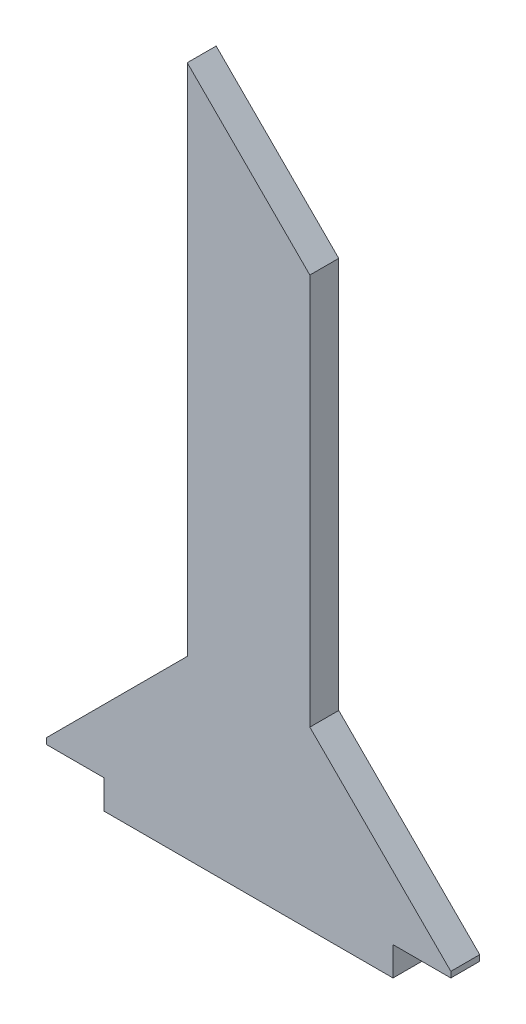
ISO-10303-21;
HEADER;
FILE_DESCRIPTION(('STEP AP214'),'2;1');
FILE_NAME('part.step','',(''),(''),'','','');
FILE_SCHEMA(('AUTOMOTIVE_DESIGN { 1 0 10303 214 1 1 1 1 }'));
ENDSEC;
DATA;
#1=APPLICATION_CONTEXT('core data for automotive mechanical design processes');
#2=APPLICATION_PROTOCOL_DEFINITION('international standard','automotive_design',2000,#1);
#3=PRODUCT_CONTEXT('',#1,'mechanical');
#4=PRODUCT('Part','Part','',(#3));
#5=PRODUCT_RELATED_PRODUCT_CATEGORY('part','',(#4));
#6=PRODUCT_DEFINITION_FORMATION('','',#4);
#7=PRODUCT_DEFINITION_CONTEXT('part definition',#1,'design');
#8=PRODUCT_DEFINITION('design','',#6,#7);
#9=PRODUCT_DEFINITION_SHAPE('','',#8);
#10=(LENGTH_UNIT() NAMED_UNIT(*) SI_UNIT(.MILLI.,.METRE.));
#11=(NAMED_UNIT(*) PLANE_ANGLE_UNIT() SI_UNIT($,.RADIAN.));
#12=(NAMED_UNIT(*) SI_UNIT($,.STERADIAN.) SOLID_ANGLE_UNIT());
#13=UNCERTAINTY_MEASURE_WITH_UNIT(LENGTH_MEASURE(1.E-05),#10,'distance_accuracy_value','');
#14=(GEOMETRIC_REPRESENTATION_CONTEXT(3) GLOBAL_UNCERTAINTY_ASSIGNED_CONTEXT((#13)) GLOBAL_UNIT_ASSIGNED_CONTEXT((#10,
#11,#12)) REPRESENTATION_CONTEXT('',''));
#15=CARTESIAN_POINT('',(0.,0.,0.));
#16=DIRECTION('',(0.,0.,1.));
#17=DIRECTION('',(1.,0.,0.));
#18=AXIS2_PLACEMENT_3D('',#15,#16,#17);
#19=CARTESIAN_POINT('',(150.000000000002,-163.786796564407,20.));
#20=DIRECTION('',(1.,0.,0.));
#21=DIRECTION('',(0.,1.,0.));
#22=AXIS2_PLACEMENT_3D('',#19,#20,#21);
#23=PLANE('',#22);
#24=DIRECTION('',(0.,-1.,0.));
#25=VECTOR('',#24,1.);
#26=CARTESIAN_POINT('',(150.000000000002,-163.786796564407,0.));
#27=LINE('',#26,#25);
#28=CARTESIAN_POINT('',(150.,-143.786796564407,0.));
#29=VERTEX_POINT('',#28);
#30=CARTESIAN_POINT('',(150.000000000002,-163.786796564407,0.));
#31=VERTEX_POINT('',#30);
#32=EDGE_CURVE('E153',#29,#31,#27,.T.);
#33=ORIENTED_EDGE('',*,*,#32,.T.);
#34=DIRECTION('',(0.,0.,-1.));
#35=VECTOR('',#34,1.);
#36=CARTESIAN_POINT('',(150.000000000002,-163.786796564407,20.));
#37=LINE('',#36,#35);
#38=CARTESIAN_POINT('',(150.000000000002,-163.786796564407,20.));
#39=VERTEX_POINT('',#38);
#40=EDGE_CURVE('E11',#39,#31,#37,.T.);
#41=ORIENTED_EDGE('',*,*,#40,.F.);
#42=DIRECTION('',(0.,-1.,0.));
#43=VECTOR('',#42,1.);
#44=CARTESIAN_POINT('',(150.000000000002,-163.786796564407,20.));
#45=LINE('',#44,#43);
#46=CARTESIAN_POINT('',(150.,-143.786796564407,20.));
#47=VERTEX_POINT('',#46);
#48=EDGE_CURVE('E175',#47,#39,#45,.T.);
#49=ORIENTED_EDGE('',*,*,#48,.F.);
#50=DIRECTION('',(0.,0.,-1.));
#51=VECTOR('',#50,1.);
#52=CARTESIAN_POINT('',(150.,-143.786796564407,20.));
#53=LINE('',#52,#51);
#54=EDGE_CURVE('E149',#47,#29,#53,.T.);
#55=ORIENTED_EDGE('',*,*,#54,.T.);
#56=EDGE_LOOP('',(#33,#41,#49,#55));
#57=FACE_BOUND('',#56,.T.);
#58=ADVANCED_FACE('F33',(#57),#23,.F.);
#59=CARTESIAN_POINT('',(150.000000000002,-163.786796564407,20.));
#60=DIRECTION('',(0.,1.,0.));
#61=DIRECTION('',(0.,0.,1.));
#62=AXIS2_PLACEMENT_3D('',#59,#60,#61);
#63=PLANE('',#62);
#64=DIRECTION('',(1.,0.,0.));
#65=VECTOR('',#64,1.);
#66=CARTESIAN_POINT('',(150.000000000002,-163.786796564407,0.));
#67=LINE('',#66,#65);
#68=CARTESIAN_POINT('',(350.000000000002,-163.786796564407,0.));
#69=VERTEX_POINT('',#68);
#70=EDGE_CURVE('E156',#31,#69,#67,.T.);
#71=ORIENTED_EDGE('',*,*,#70,.T.);
#72=DIRECTION('',(0.,0.,-1.));
#73=VECTOR('',#72,1.);
#74=CARTESIAN_POINT('',(350.000000000002,-163.786796564407,20.));
#75=LINE('',#74,#73);
#76=CARTESIAN_POINT('',(350.000000000002,-163.786796564407,20.));
#77=VERTEX_POINT('',#76);
#78=EDGE_CURVE('E41',#77,#69,#75,.T.);
#79=ORIENTED_EDGE('',*,*,#78,.F.);
#80=DIRECTION('',(1.,0.,0.));
#81=VECTOR('',#80,1.);
#82=CARTESIAN_POINT('',(150.000000000002,-163.786796564407,20.));
#83=LINE('',#82,#81);
#84=EDGE_CURVE('E104',#39,#77,#83,.T.);
#85=ORIENTED_EDGE('',*,*,#84,.F.);
#86=ORIENTED_EDGE('',*,*,#40,.T.);
#87=EDGE_LOOP('',(#71,#79,#85,#86));
#88=FACE_BOUND('',#87,.T.);
#89=ADVANCED_FACE('F253',(#88),#63,.F.);
#90=CARTESIAN_POINT('',(350.000000000002,-163.786796564407,20.));
#91=DIRECTION('',(-1.,0.,0.));
#92=DIRECTION('',(0.,-1.,0.));
#93=AXIS2_PLACEMENT_3D('',#90,#91,#92);
#94=PLANE('',#93);
#95=DIRECTION('',(0.,1.,0.));
#96=VECTOR('',#95,1.);
#97=CARTESIAN_POINT('',(350.000000000002,-163.786796564407,0.));
#98=LINE('',#97,#96);
#99=CARTESIAN_POINT('',(350.000000000002,-143.786796564407,0.));
#100=VERTEX_POINT('',#99);
#101=EDGE_CURVE('E158',#69,#100,#98,.T.);
#102=ORIENTED_EDGE('',*,*,#101,.T.);
#103=DIRECTION('',(0.,0.,-1.));
#104=VECTOR('',#103,1.);
#105=CARTESIAN_POINT('',(350.000000000002,-143.786796564407,20.));
#106=LINE('',#105,#104);
#107=CARTESIAN_POINT('',(350.000000000002,-143.786796564407,20.));
#108=VERTEX_POINT('',#107);
#109=EDGE_CURVE('E194',#108,#100,#106,.T.);
#110=ORIENTED_EDGE('',*,*,#109,.F.);
#111=DIRECTION('',(0.,1.,0.));
#112=VECTOR('',#111,1.);
#113=CARTESIAN_POINT('',(350.000000000002,-163.786796564407,20.));
#114=LINE('',#113,#112);
#115=EDGE_CURVE('E202',#77,#108,#114,.T.);
#116=ORIENTED_EDGE('',*,*,#115,.F.);
#117=ORIENTED_EDGE('',*,*,#78,.T.);
#118=EDGE_LOOP('',(#102,#110,#116,#117));
#119=FACE_BOUND('',#118,.T.);
#120=ADVANCED_FACE('F200',(#119),#94,.F.);
#121=CARTESIAN_POINT('',(350.000000000002,-143.786796564407,20.));
#122=DIRECTION('',(0.,1.,0.));
#123=DIRECTION('',(0.,0.,1.));
#124=AXIS2_PLACEMENT_3D('',#121,#122,#123);
#125=PLANE('',#124);
#126=DIRECTION('',(1.,0.,0.));
#127=VECTOR('',#126,1.);
#128=CARTESIAN_POINT('',(350.000000000002,-143.786796564407,0.));
#129=LINE('',#128,#127);
#130=CARTESIAN_POINT('',(390.000000000002,-143.786796564407,0.));
#131=VERTEX_POINT('',#130);
#132=EDGE_CURVE('E160',#100,#131,#129,.T.);
#133=ORIENTED_EDGE('',*,*,#132,.T.);
#134=DIRECTION('',(0.,0.,-1.));
#135=VECTOR('',#134,1.);
#136=CARTESIAN_POINT('',(390.000000000002,-143.786796564407,20.));
#137=LINE('',#136,#135);
#138=CARTESIAN_POINT('',(390.000000000002,-143.786796564407,20.));
#139=VERTEX_POINT('',#138);
#140=EDGE_CURVE('E191',#139,#131,#137,.T.);
#141=ORIENTED_EDGE('',*,*,#140,.F.);
#142=DIRECTION('',(1.,0.,0.));
#143=VECTOR('',#142,1.);
#144=CARTESIAN_POINT('',(350.000000000002,-143.786796564407,20.));
#145=LINE('',#144,#143);
#146=EDGE_CURVE('E220',#108,#139,#145,.T.);
#147=ORIENTED_EDGE('',*,*,#146,.F.);
#148=ORIENTED_EDGE('',*,*,#109,.T.);
#149=EDGE_LOOP('',(#133,#141,#147,#148));
#150=FACE_BOUND('',#149,.T.);
#151=ADVANCED_FACE('F211',(#150),#125,.F.);
#152=CARTESIAN_POINT('',(390.000000000002,-143.786796564407,20.));
#153=DIRECTION('',(-1.,0.,0.));
#154=DIRECTION('',(0.,-1.,0.));
#155=AXIS2_PLACEMENT_3D('',#152,#153,#154);
#156=PLANE('',#155);
#157=DIRECTION('',(0.,1.,0.));
#158=VECTOR('',#157,1.);
#159=CARTESIAN_POINT('',(390.000000000002,-143.786796564407,0.));
#160=LINE('',#159,#158);
#161=CARTESIAN_POINT('',(390.000000000002,-139.786796564407,0.));
#162=VERTEX_POINT('',#161);
#163=EDGE_CURVE('E162',#131,#162,#160,.T.);
#164=ORIENTED_EDGE('',*,*,#163,.T.);
#165=DIRECTION('',(0.,0.,-1.));
#166=VECTOR('',#165,1.);
#167=CARTESIAN_POINT('',(390.000000000002,-139.786796564407,20.));
#168=LINE('',#167,#166);
#169=CARTESIAN_POINT('',(390.000000000002,-139.786796564407,20.));
#170=VERTEX_POINT('',#169);
#171=EDGE_CURVE('E188',#170,#162,#168,.T.);
#172=ORIENTED_EDGE('',*,*,#171,.F.);
#173=DIRECTION('',(0.,1.,0.));
#174=VECTOR('',#173,1.);
#175=CARTESIAN_POINT('',(390.000000000002,-143.786796564407,20.));
#176=LINE('',#175,#174);
#177=EDGE_CURVE('E217',#139,#170,#176,.T.);
#178=ORIENTED_EDGE('',*,*,#177,.F.);
#179=ORIENTED_EDGE('',*,*,#140,.T.);
#180=EDGE_LOOP('',(#164,#172,#178,#179));
#181=FACE_BOUND('',#180,.T.);
#182=ADVANCED_FACE('F215',(#181),#156,.F.);
#183=CARTESIAN_POINT('',(390.000000000002,-139.786796564407,20.));
#184=DIRECTION('',(-0.707106781186543,-0.707106781186552,0.));
#185=DIRECTION('',(0.707106781186552,-0.707106781186543,0.));
#186=AXIS2_PLACEMENT_3D('',#183,#184,#185);
#187=PLANE('',#186);
#188=DIRECTION('',(-0.707106781186552,0.707106781186543,0.));
#189=VECTOR('',#188,1.);
#190=CARTESIAN_POINT('',(390.000000000002,-139.786796564407,0.));
#191=LINE('',#190,#189);
#192=CARTESIAN_POINT('',(292.426406871195,-42.2132034356011,0.));
#193=VERTEX_POINT('',#192);
#194=EDGE_CURVE('E164',#162,#193,#191,.T.);
#195=ORIENTED_EDGE('',*,*,#194,.T.);
#196=DIRECTION('',(0.,0.,-1.));
#197=VECTOR('',#196,1.);
#198=CARTESIAN_POINT('',(292.426406871195,-42.2132034356011,20.));
#199=LINE('',#198,#197);
#200=CARTESIAN_POINT('',(292.426406871195,-42.2132034356011,20.));
#201=VERTEX_POINT('',#200);
#202=EDGE_CURVE('E185',#201,#193,#199,.T.);
#203=ORIENTED_EDGE('',*,*,#202,.F.);
#204=DIRECTION('',(-0.707106781186552,0.707106781186543,0.));
#205=VECTOR('',#204,1.);
#206=CARTESIAN_POINT('',(390.000000000002,-139.786796564407,20.));
#207=LINE('',#206,#205);
#208=EDGE_CURVE('E219',#170,#201,#207,.T.);
#209=ORIENTED_EDGE('',*,*,#208,.F.);
#210=ORIENTED_EDGE('',*,*,#171,.T.);
#211=EDGE_LOOP('',(#195,#203,#209,#210));
#212=FACE_BOUND('',#211,.T.);
#213=ADVANCED_FACE('F266',(#212),#187,.F.);
#214=CARTESIAN_POINT('',(292.426406871195,-42.2132034356011,20.));
#215=DIRECTION('',(-1.,0.,0.));
#216=DIRECTION('',(0.,-1.,0.));
#217=AXIS2_PLACEMENT_3D('',#214,#215,#216);
#218=PLANE('',#217);
#219=DIRECTION('',(0.,1.,0.));
#220=VECTOR('',#219,1.);
#221=CARTESIAN_POINT('',(292.426406871195,-42.2132034356011,0.));
#222=LINE('',#221,#220);
#223=CARTESIAN_POINT('',(292.426406871193,228.786796564401,0.));
#224=VERTEX_POINT('',#223);
#225=EDGE_CURVE('E166',#193,#224,#222,.T.);
#226=ORIENTED_EDGE('',*,*,#225,.T.);
#227=DIRECTION('',(0.,0.,-1.));
#228=VECTOR('',#227,1.);
#229=CARTESIAN_POINT('',(292.426406871193,228.786796564401,20.));
#230=LINE('',#229,#228);
#231=CARTESIAN_POINT('',(292.426406871193,228.786796564401,20.));
#232=VERTEX_POINT('',#231);
#233=EDGE_CURVE('E182',#232,#224,#230,.T.);
#234=ORIENTED_EDGE('',*,*,#233,.F.);
#235=DIRECTION('',(0.,1.,0.));
#236=VECTOR('',#235,1.);
#237=CARTESIAN_POINT('',(292.426406871195,-42.2132034356011,20.));
#238=LINE('',#237,#236);
#239=EDGE_CURVE('E222',#201,#232,#238,.T.);
#240=ORIENTED_EDGE('',*,*,#239,.F.);
#241=ORIENTED_EDGE('',*,*,#202,.T.);
#242=EDGE_LOOP('',(#226,#234,#240,#241));
#243=FACE_BOUND('',#242,.T.);
#244=ADVANCED_FACE('F269',(#243),#218,.F.);
#245=CARTESIAN_POINT('',(207.573593128807,313.639610306786,20.));
#246=DIRECTION('',(-0.707106781186543,-0.707106781186552,0.));
#247=DIRECTION('',(0.707106781186552,-0.707106781186543,0.));
#248=AXIS2_PLACEMENT_3D('',#245,#246,#247);
#249=PLANE('',#248);
#250=DIRECTION('',(-0.707106781186552,0.707106781186543,0.));
#251=VECTOR('',#250,1.);
#252=CARTESIAN_POINT('',(207.573593128807,313.639610306786,0.));
#253=LINE('',#252,#251);
#254=CARTESIAN_POINT('',(207.573593128807,313.639610306786,0.));
#255=VERTEX_POINT('',#254);
#256=EDGE_CURVE('E168',#224,#255,#253,.T.);
#257=ORIENTED_EDGE('',*,*,#256,.T.);
#258=DIRECTION('',(0.,0.,-1.));
#259=VECTOR('',#258,1.);
#260=CARTESIAN_POINT('',(207.573593128807,313.639610306786,20.));
#261=LINE('',#260,#259);
#262=CARTESIAN_POINT('',(207.573593128807,313.639610306786,20.));
#263=VERTEX_POINT('',#262);
#264=EDGE_CURVE('E179',#263,#255,#261,.T.);
#265=ORIENTED_EDGE('',*,*,#264,.F.);
#266=DIRECTION('',(-0.707106781186552,0.707106781186543,0.));
#267=VECTOR('',#266,1.);
#268=CARTESIAN_POINT('',(207.573593128807,313.639610306786,20.));
#269=LINE('',#268,#267);
#270=EDGE_CURVE('E228',#232,#263,#269,.T.);
#271=ORIENTED_EDGE('',*,*,#270,.F.);
#272=ORIENTED_EDGE('',*,*,#233,.T.);
#273=EDGE_LOOP('',(#257,#265,#271,#272));
#274=FACE_BOUND('',#273,.T.);
#275=ADVANCED_FACE('F234',(#274),#249,.F.);
#276=CARTESIAN_POINT('',(207.573593128808,-42.2132034355986,20.));
#277=DIRECTION('',(1.,0.,0.));
#278=DIRECTION('',(0.,1.,0.));
#279=AXIS2_PLACEMENT_3D('',#276,#277,#278);
#280=PLANE('',#279);
#281=DIRECTION('',(0.,-1.,0.));
#282=VECTOR('',#281,1.);
#283=CARTESIAN_POINT('',(207.573593128808,-42.2132034355986,0.));
#284=LINE('',#283,#282);
#285=CARTESIAN_POINT('',(207.573593128808,-42.2132034355986,0.));
#286=VERTEX_POINT('',#285);
#287=EDGE_CURVE('E170',#255,#286,#284,.T.);
#288=ORIENTED_EDGE('',*,*,#287,.T.);
#289=DIRECTION('',(0.,0.,-1.));
#290=VECTOR('',#289,1.);
#291=CARTESIAN_POINT('',(207.573593128808,-42.2132034355986,20.));
#292=LINE('',#291,#290);
#293=CARTESIAN_POINT('',(207.573593128808,-42.2132034355986,20.));
#294=VERTEX_POINT('',#293);
#295=EDGE_CURVE('E144',#294,#286,#292,.T.);
#296=ORIENTED_EDGE('',*,*,#295,.F.);
#297=DIRECTION('',(0.,-1.,0.));
#298=VECTOR('',#297,1.);
#299=CARTESIAN_POINT('',(207.573593128808,-42.2132034355986,20.));
#300=LINE('',#299,#298);
#301=EDGE_CURVE('E135',#263,#294,#300,.T.);
#302=ORIENTED_EDGE('',*,*,#301,.F.);
#303=ORIENTED_EDGE('',*,*,#264,.T.);
#304=EDGE_LOOP('',(#288,#296,#302,#303));
#305=FACE_BOUND('',#304,.T.);
#306=ADVANCED_FACE('F238',(#305),#280,.F.);
#307=CARTESIAN_POINT('',(110.,-139.786796564407,20.));
#308=DIRECTION('',(0.707106781186546,-0.707106781186549,0.));
#309=DIRECTION('',(0.707106781186549,0.707106781186546,0.));
#310=AXIS2_PLACEMENT_3D('',#307,#308,#309);
#311=PLANE('',#310);
#312=DIRECTION('',(-0.707106781186549,-0.707106781186546,0.));
#313=VECTOR('',#312,1.);
#314=CARTESIAN_POINT('',(110.,-139.786796564407,0.));
#315=LINE('',#314,#313);
#316=CARTESIAN_POINT('',(110.,-139.786796564407,0.));
#317=VERTEX_POINT('',#316);
#318=EDGE_CURVE('E143',#286,#317,#315,.T.);
#319=ORIENTED_EDGE('',*,*,#318,.T.);
#320=DIRECTION('',(0.,0.,-1.));
#321=VECTOR('',#320,1.);
#322=CARTESIAN_POINT('',(110.,-139.786796564407,20.));
#323=LINE('',#322,#321);
#324=CARTESIAN_POINT('',(110.,-139.786796564407,20.));
#325=VERTEX_POINT('',#324);
#326=EDGE_CURVE('E140',#325,#317,#323,.T.);
#327=ORIENTED_EDGE('',*,*,#326,.F.);
#328=DIRECTION('',(-0.707106781186549,-0.707106781186546,0.));
#329=VECTOR('',#328,1.);
#330=CARTESIAN_POINT('',(110.,-139.786796564407,20.));
#331=LINE('',#330,#329);
#332=EDGE_CURVE('E129',#294,#325,#331,.T.);
#333=ORIENTED_EDGE('',*,*,#332,.F.);
#334=ORIENTED_EDGE('',*,*,#295,.T.);
#335=EDGE_LOOP('',(#319,#327,#333,#334));
#336=FACE_BOUND('',#335,.T.);
#337=ADVANCED_FACE('F141',(#336),#311,.F.);
#338=CARTESIAN_POINT('',(110.,-143.786796564407,20.));
#339=DIRECTION('',(1.,0.,0.));
#340=DIRECTION('',(0.,0.,-1.));
#341=AXIS2_PLACEMENT_3D('',#338,#339,#340);
#342=PLANE('',#341);
#343=DIRECTION('',(0.,-1.,0.));
#344=VECTOR('',#343,1.);
#345=CARTESIAN_POINT('',(110.,-143.786796564407,0.));
#346=LINE('',#345,#344);
#347=CARTESIAN_POINT('',(110.,-143.786796564407,0.));
#348=VERTEX_POINT('',#347);
#349=EDGE_CURVE('E90',#317,#348,#346,.T.);
#350=ORIENTED_EDGE('',*,*,#349,.T.);
#351=DIRECTION('',(0.,0.,-1.));
#352=VECTOR('',#351,1.);
#353=CARTESIAN_POINT('',(110.,-143.786796564407,20.));
#354=LINE('',#353,#352);
#355=CARTESIAN_POINT('',(110.,-143.786796564407,20.));
#356=VERTEX_POINT('',#355);
#357=EDGE_CURVE('E145',#356,#348,#354,.T.);
#358=ORIENTED_EDGE('',*,*,#357,.F.);
#359=DIRECTION('',(0.,-1.,0.));
#360=VECTOR('',#359,1.);
#361=CARTESIAN_POINT('',(110.,-143.786796564407,20.));
#362=LINE('',#361,#360);
#363=EDGE_CURVE('E133',#325,#356,#362,.T.);
#364=ORIENTED_EDGE('',*,*,#363,.F.);
#365=ORIENTED_EDGE('',*,*,#326,.T.);
#366=EDGE_LOOP('',(#350,#358,#364,#365));
#367=FACE_BOUND('',#366,.T.);
#368=ADVANCED_FACE('F147',(#367),#342,.F.);
#369=CARTESIAN_POINT('',(150.,-143.786796564407,20.));
#370=DIRECTION('',(0.,1.,0.));
#371=DIRECTION('',(-1.,0.,0.));
#372=AXIS2_PLACEMENT_3D('',#369,#370,#371);
#373=PLANE('',#372);
#374=DIRECTION('',(1.,0.,0.));
#375=VECTOR('',#374,1.);
#376=CARTESIAN_POINT('',(150.,-143.786796564407,0.));
#377=LINE('',#376,#375);
#378=EDGE_CURVE('E96',#348,#29,#377,.T.);
#379=ORIENTED_EDGE('',*,*,#378,.T.);
#380=ORIENTED_EDGE('',*,*,#54,.F.);
#381=DIRECTION('',(1.,0.,0.));
#382=VECTOR('',#381,1.);
#383=CARTESIAN_POINT('',(150.,-143.786796564407,20.));
#384=LINE('',#383,#382);
#385=EDGE_CURVE('E49',#356,#47,#384,.T.);
#386=ORIENTED_EDGE('',*,*,#385,.F.);
#387=ORIENTED_EDGE('',*,*,#357,.T.);
#388=EDGE_LOOP('',(#379,#380,#386,#387));
#389=FACE_BOUND('',#388,.T.);
#390=ADVANCED_FACE('F242',(#389),#373,.F.);
#391=CARTESIAN_POINT('',(150.,-143.786796564407,20.));
#392=DIRECTION('',(0.,0.,1.));
#393=DIRECTION('',(1.,0.,0.));
#394=AXIS2_PLACEMENT_3D('',#391,#392,#393);
#395=PLANE('',#394);
#396=ORIENTED_EDGE('',*,*,#48,.T.);
#397=ORIENTED_EDGE('',*,*,#84,.T.);
#398=ORIENTED_EDGE('',*,*,#115,.T.);
#399=ORIENTED_EDGE('',*,*,#146,.T.);
#400=ORIENTED_EDGE('',*,*,#177,.T.);
#401=ORIENTED_EDGE('',*,*,#208,.T.);
#402=ORIENTED_EDGE('',*,*,#239,.T.);
#403=ORIENTED_EDGE('',*,*,#270,.T.);
#404=ORIENTED_EDGE('',*,*,#301,.T.);
#405=ORIENTED_EDGE('',*,*,#332,.T.);
#406=ORIENTED_EDGE('',*,*,#363,.T.);
#407=ORIENTED_EDGE('',*,*,#385,.T.);
#408=EDGE_LOOP('',(#396,#397,#398,#399,#400,#401,#402,#403,#404,#405,#406,#407));
#409=FACE_BOUND('',#408,.T.);
#410=ADVANCED_FACE('F131',(#409),#395,.T.);
#411=CARTESIAN_POINT('',(150.,-143.786796564407,0.));
#412=DIRECTION('',(0.,0.,1.));
#413=DIRECTION('',(1.,0.,0.));
#414=AXIS2_PLACEMENT_3D('',#411,#412,#413);
#415=PLANE('',#414);
#416=ORIENTED_EDGE('',*,*,#32,.F.);
#417=ORIENTED_EDGE('',*,*,#378,.F.);
#418=ORIENTED_EDGE('',*,*,#349,.F.);
#419=ORIENTED_EDGE('',*,*,#318,.F.);
#420=ORIENTED_EDGE('',*,*,#287,.F.);
#421=ORIENTED_EDGE('',*,*,#256,.F.);
#422=ORIENTED_EDGE('',*,*,#225,.F.);
#423=ORIENTED_EDGE('',*,*,#194,.F.);
#424=ORIENTED_EDGE('',*,*,#163,.F.);
#425=ORIENTED_EDGE('',*,*,#132,.F.);
#426=ORIENTED_EDGE('',*,*,#101,.F.);
#427=ORIENTED_EDGE('',*,*,#70,.F.);
#428=EDGE_LOOP('',(#416,#417,#418,#419,#420,#421,#422,#423,#424,#425,#426,#427));
#429=FACE_BOUND('',#428,.T.);
#430=ADVANCED_FACE('F206',(#429),#415,.F.);
#431=CLOSED_SHELL('',(#58,#89,#120,#151,#182,#213,#244,#275,#306,#337,#368,#390,#410,#430));
#432=MANIFOLD_SOLID_BREP('B2',#431);
#433=ADVANCED_BREP_SHAPE_REPRESENTATION('',(#18,#432),#14);
#434=SHAPE_DEFINITION_REPRESENTATION(#9,#433);
ENDSEC;
END-ISO-10303-21;
